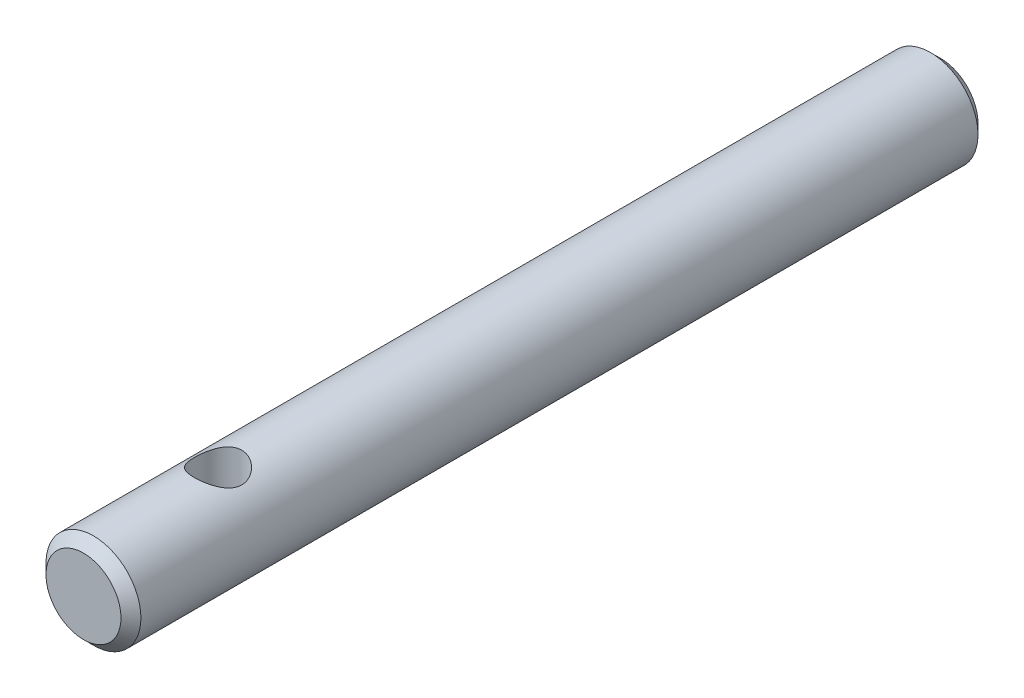
ISO-10303-21;
HEADER;
FILE_DESCRIPTION(('STEP AP214'),'2;1');
FILE_NAME('part.step','',(''),(''),'','','');
FILE_SCHEMA(('AUTOMOTIVE_DESIGN { 1 0 10303 214 1 1 1 1 }'));
ENDSEC;
DATA;
#1=APPLICATION_CONTEXT('core data for automotive mechanical design processes');
#2=APPLICATION_PROTOCOL_DEFINITION('international standard','automotive_design',2000,#1);
#3=PRODUCT_CONTEXT('',#1,'mechanical');
#4=PRODUCT('Part','Part','',(#3));
#5=PRODUCT_RELATED_PRODUCT_CATEGORY('part','',(#4));
#6=PRODUCT_DEFINITION_FORMATION('','',#4);
#7=PRODUCT_DEFINITION_CONTEXT('part definition',#1,'design');
#8=PRODUCT_DEFINITION('design','',#6,#7);
#9=PRODUCT_DEFINITION_SHAPE('','',#8);
#10=(LENGTH_UNIT() NAMED_UNIT(*) SI_UNIT(.MILLI.,.METRE.));
#11=(NAMED_UNIT(*) PLANE_ANGLE_UNIT() SI_UNIT($,.RADIAN.));
#12=(NAMED_UNIT(*) SI_UNIT($,.STERADIAN.) SOLID_ANGLE_UNIT());
#13=UNCERTAINTY_MEASURE_WITH_UNIT(LENGTH_MEASURE(1.E-05),#10,'distance_accuracy_value','');
#14=(GEOMETRIC_REPRESENTATION_CONTEXT(3) GLOBAL_UNCERTAINTY_ASSIGNED_CONTEXT((#13)) GLOBAL_UNIT_ASSIGNED_CONTEXT((#10,
#11,#12)) REPRESENTATION_CONTEXT('',''));
#15=CARTESIAN_POINT('',(0.,0.,0.));
#16=DIRECTION('',(0.,0.,1.));
#17=DIRECTION('',(1.,0.,0.));
#18=AXIS2_PLACEMENT_3D('',#15,#16,#17);
#19=CARTESIAN_POINT('',(0.,0.,-43.));
#20=DIRECTION('',(0.,0.,1.));
#21=DIRECTION('',(1.,0.,0.));
#22=AXIS2_PLACEMENT_3D('',#19,#20,#21);
#23=CYLINDRICAL_SURFACE('',#22,2.38125);
#24=CARTESIAN_POINT('',(0.,0.,-42.5));
#25=DIRECTION('',(0.,0.,1.));
#26=DIRECTION('',(1.,0.,0.));
#27=AXIS2_PLACEMENT_3D('',#24,#25,#26);
#28=CIRCLE('',#27,2.38125);
#29=CARTESIAN_POINT('',(2.38125,0.,-42.5));
#30=VERTEX_POINT('',#29);
#31=EDGE_CURVE('E42',#30,#30,#28,.T.);
#32=ORIENTED_EDGE('',*,*,#31,.T.);
#33=EDGE_LOOP('',(#32));
#34=FACE_BOUND('',#33,.T.);
#35=CARTESIAN_POINT('',(0.,0.,-0.499999999999994));
#36=DIRECTION('',(0.,0.,1.));
#37=DIRECTION('',(1.,0.,0.));
#38=AXIS2_PLACEMENT_3D('',#35,#36,#37);
#39=CIRCLE('',#38,2.38125);
#40=CARTESIAN_POINT('',(2.38125,0.,-0.499999999999994));
#41=VERTEX_POINT('',#40);
#42=EDGE_CURVE('E46',#41,#41,#39,.F.);
#43=ORIENTED_EDGE('',*,*,#42,.T.);
#44=EDGE_LOOP('',(#43));
#45=FACE_BOUND('',#44,.T.);
#46=CARTESIAN_POINT('',(0.,-2.38125,-5.559375));
#47=CARTESIAN_POINT('',(-0.0625934933908995,-2.38124658771817,-5.55937893182416));
#48=CARTESIAN_POINT('',(-0.12526160776547,-2.37875553370113,-5.56433999331049));
#49=CARTESIAN_POINT('',(-0.248745655116468,-2.36903604532025,-5.58396483565591));
#50=CARTESIAN_POINT('',(-0.309557840743265,-2.36179861446384,-5.59864704291283));
#51=CARTESIAN_POINT('',(-0.427355251873434,-2.34334382664568,-5.63699637838437));
#52=CARTESIAN_POINT('',(-0.484354349749461,-2.33214194770735,-5.66062858874529));
#53=CARTESIAN_POINT('',(-0.593493959385316,-2.30678565164099,-5.71602627106263));
#54=CARTESIAN_POINT('',(-0.645634853781903,-2.29263146732422,-5.74779110174629));
#55=CARTESIAN_POINT('',(-0.747126495522785,-2.26166669988499,-5.82073772516843));
#56=CARTESIAN_POINT('',(-0.796117610742265,-2.24474721461222,-5.8623729643447));
#57=CARTESIAN_POINT('',(-0.886753026544745,-2.2105140207503,-5.9529021362285));
#58=CARTESIAN_POINT('',(-0.928391728636494,-2.19320002298882,-6.00180154851656));
#59=CARTESIAN_POINT('',(-1.00637816303611,-2.15859063769341,-6.11001923802628));
#60=CARTESIAN_POINT('',(-1.04206516514117,-2.14140081986313,-6.1698514170931));
#61=CARTESIAN_POINT('',(-1.10271904514173,-2.11081118475794,-6.29561860940859));
#62=CARTESIAN_POINT('',(-1.12769358094429,-2.09740866244572,-6.36154922201052));
#63=CARTESIAN_POINT('',(-1.16458893898079,-2.07713897941891,-6.49361689114297));
#64=CARTESIAN_POINT('',(-1.1772017235864,-2.06992860854359,-6.55950530074274));
#65=CARTESIAN_POINT('',(-1.19113338890834,-2.06194687719966,-6.69282480373119));
#66=CARTESIAN_POINT('',(-1.19246343021919,-2.06116915374352,-6.76025430647472));
#67=CARTESIAN_POINT('',(-1.18429955128951,-2.06586451337536,-6.88607179770048));
#68=CARTESIAN_POINT('',(-1.17608099119853,-2.07060121735085,-6.94457673717494));
#69=CARTESIAN_POINT('',(-1.15126275778341,-2.0845013483624,-7.05923139834728));
#70=CARTESIAN_POINT('',(-1.13466041470314,-2.09366618546584,-7.11538036362914));
#71=CARTESIAN_POINT('',(-1.09324351977209,-2.1155915160392,-7.22533218596099));
#72=CARTESIAN_POINT('',(-1.06824668928498,-2.12843079040573,-7.27904993105433));
#73=CARTESIAN_POINT('',(-1.01089025937972,-2.15626240722546,-7.38178645461498));
#74=CARTESIAN_POINT('',(-0.978527352789219,-2.17125571566414,-7.43080310832385));
#75=CARTESIAN_POINT('',(-0.902572396630539,-2.204003536286,-7.5292893665474));
#76=CARTESIAN_POINT('',(-0.858076839495926,-2.22186710625626,-7.57802834010161));
#77=CARTESIAN_POINT('',(-0.761470860938948,-2.25680138992047,-7.66765685775979));
#78=CARTESIAN_POINT('',(-0.709356821108759,-2.27387172175947,-7.70854265051534));
#79=CARTESIAN_POINT('',(-0.595927464756045,-2.30626428608779,-7.78308824016352));
#80=CARTESIAN_POINT('',(-0.534297244998047,-2.3214685301789,-7.81632431250571));
#81=CARTESIAN_POINT('',(-0.40536758781635,-2.34741102209979,-7.87168427520433));
#82=CARTESIAN_POINT('',(-0.338072701740846,-2.35815281492167,-7.89381698903368));
#83=CARTESIAN_POINT('',(-0.205700104133524,-2.37320534860897,-7.92452227755017));
#84=CARTESIAN_POINT('',(-0.140900384809099,-2.37797504664999,-7.93406612756101));
#85=CARTESIAN_POINT('',(-0.0104532111896999,-2.38211931649743,-7.942368945507));
#86=CARTESIAN_POINT('',(0.0551938267826007,-2.38149644415062,-7.9411330225895));
#87=CARTESIAN_POINT('',(0.180061757270823,-2.37519200776753,-7.92847266160142));
#88=CARTESIAN_POINT('',(0.239386357709476,-2.36990626897501,-7.91784532821831));
#89=CARTESIAN_POINT('',(0.355290706146969,-2.35532022721706,-7.88795404564991));
#90=CARTESIAN_POINT('',(0.411870150775842,-2.34601948166815,-7.86868914431647));
#91=CARTESIAN_POINT('',(0.522551749435382,-2.323912493394,-7.82156432590301));
#92=CARTESIAN_POINT('',(0.576536816435451,-2.31101362357334,-7.79347440595467));
#93=CARTESIAN_POINT('',(0.679205558772777,-2.28295169421308,-7.72975634037143));
#94=CARTESIAN_POINT('',(0.727886962326195,-2.26778767095513,-7.6941249834997));
#95=CARTESIAN_POINT('',(0.823635905061683,-2.23490101029919,-7.61229774358805));
#96=CARTESIAN_POINT('',(0.87007550515996,-2.21707334772676,-7.56540802224747));
#97=CARTESIAN_POINT('',(0.95471018232545,-2.18196785003363,-7.46446411676999));
#98=CARTESIAN_POINT('',(0.992899556088157,-2.1646904022613,-7.41040501790926));
#99=CARTESIAN_POINT('',(1.06168973569882,-2.13182825744162,-7.29334927421775));
#100=CARTESIAN_POINT('',(1.0918334810305,-2.11636605630571,-7.23004658617039));
#101=CARTESIAN_POINT('',(1.14071736472268,-2.090428799133,-7.09824582565359));
#102=CARTESIAN_POINT('',(1.15947219672864,-2.07994732092736,-7.02975457625952));
#103=CARTESIAN_POINT('',(1.18331657161977,-2.06646662138444,-6.89655376590559));
#104=CARTESIAN_POINT('',(1.18954509883978,-2.06284572182647,-6.83211234201105));
#105=CARTESIAN_POINT('',(1.19144552443462,-2.06175000375602,-6.70303333564985));
#106=CARTESIAN_POINT('',(1.18712199863717,-2.06427252119055,-6.63839585034461));
#107=CARTESIAN_POINT('',(1.16910579328329,-2.07451954503311,-6.51725245598844));
#108=CARTESIAN_POINT('',(1.1563448992644,-2.081725593681,-6.46055850273432));
#109=CARTESIAN_POINT('',(1.12296816088622,-2.09991741148739,-6.35017845780996));
#110=CARTESIAN_POINT('',(1.10234978978715,-2.11090439637645,-6.29649334007175));
#111=CARTESIAN_POINT('',(1.05229312174863,-2.13632093965266,-6.18966228679407));
#112=CARTESIAN_POINT('',(1.02235532346272,-2.15093219477964,-6.13679490438401));
#113=CARTESIAN_POINT('',(0.955061000604868,-2.18164566727434,-6.03648875535999));
#114=CARTESIAN_POINT('',(0.917700616381016,-2.19774865799103,-5.98905283335142));
#115=CARTESIAN_POINT('',(0.831298335810089,-2.23197328511557,-5.89496220225546));
#116=CARTESIAN_POINT('',(0.781388641146486,-2.25010245755217,-5.84910275625034));
#117=CARTESIAN_POINT('',(0.674078066156022,-2.28454448778714,-5.76623063536124));
#118=CARTESIAN_POINT('',(0.616673173627611,-2.30085636405197,-5.72922272899558));
#119=CARTESIAN_POINT('',(0.495218557463749,-2.33002942662263,-5.66505920558625));
#120=CARTESIAN_POINT('',(0.43112472187215,-2.34286539970213,-5.63797509829451));
#121=CARTESIAN_POINT('',(0.298539814353396,-2.36340659560876,-5.5953221500715));
#122=CARTESIAN_POINT('',(0.230061848926332,-2.37112639390897,-5.57972058236853));
#123=CARTESIAN_POINT('',(0.134066692531779,-2.37762409336193,-5.56664089493782));
#124=CARTESIAN_POINT('',(0.107348987707653,-2.37898025606987,-5.56392004322175));
#125=CARTESIAN_POINT('',(0.0537587806828968,-2.3807939546427,-5.56028622636905));
#126=CARTESIAN_POINT('',(0.0268862742301633,-2.38125146570418,-5.55937331113273));
#127=CARTESIAN_POINT('',(0.,-2.38125,-5.559375));
#128=B_SPLINE_CURVE_WITH_KNOTS('',3,(#46,#47,#48,#49,#50,#51,#52,#53,#54,#55,#56,#57,#58,#59,
#60,#61,#62,#63,#64,#65,#66,#67,#68,#69,#70,#71,#72,#73,#74,#75,#76,#77,#78,#79,#80,#81,#82,#83,
#84,#85,#86,#87,#88,#89,#90,#91,#92,#93,#94,#95,#96,#97,#98,#99,#100,#101,#102,#103,#104,#105,
#106,#107,#108,#109,#110,#111,#112,#113,#114,#115,#116,#117,#118,#119,#120,#121,#122,#123,#124,
#125,#126,#127),.UNSPECIFIED.,.T.,.F.,(4,2,2,2,2,2,2,2,2,2,2,2,2,2,2,2,2,2,2,2,2,2,2,2,2,2,2,2,
2,2,2,2,2,2,2,2,2,2,2,2,4),(0.,0.187671381491036,0.375699515747513,0.563001503883017,
0.750288727442429,0.948906406473724,1.14767467670684,1.36185743031615,1.57588681716391,
1.7771032070446,1.97812053569865,2.15509926337347,2.33213438424011,2.51329317200605,
2.69453345625451,2.89875445775649,3.10307277131561,3.31687910824068,3.53051527011183,
3.72645730217446,3.92230647121476,4.10297598058851,4.28366541066828,4.46952119208217,
4.65545627297241,4.85965036423511,5.06398516445248,5.27821543446362,5.49216872029488,
5.68558331740251,5.87891405645819,6.0538272319698,6.22879670208066,6.41552156348465,
6.60234377481071,6.81186617152193,7.02150118957732,7.2326184126742,7.44313156831557,
7.52374130413946,7.60435326481739),.UNSPECIFIED.);
#129=CARTESIAN_POINT('',(0.,-2.38125,-5.559375));
#130=VERTEX_POINT('',#129);
#131=EDGE_CURVE('E51',#130,#130,#128,.T.);
#132=ORIENTED_EDGE('',*,*,#131,.F.);
#133=EDGE_LOOP('',(#132));
#134=FACE_BOUND('',#133,.T.);
#135=CARTESIAN_POINT('',(0.,2.38125,-5.559375));
#136=CARTESIAN_POINT('',(0.0625934933908996,2.38124658771817,-5.55937893182416));
#137=CARTESIAN_POINT('',(0.12526160776547,2.37875553370113,-5.56433999331049));
#138=CARTESIAN_POINT('',(0.248745655116469,2.36903604532025,-5.58396483565591));
#139=CARTESIAN_POINT('',(0.309557840743265,2.36179861446384,-5.59864704291283));
#140=CARTESIAN_POINT('',(0.427355251873434,2.34334382664568,-5.63699637838437));
#141=CARTESIAN_POINT('',(0.484354349749461,2.33214194770735,-5.66062858874529));
#142=CARTESIAN_POINT('',(0.593493959385317,2.30678565164099,-5.71602627106263));
#143=CARTESIAN_POINT('',(0.645634853781903,2.29263146732422,-5.74779110174629));
#144=CARTESIAN_POINT('',(0.747126495522785,2.26166669988499,-5.82073772516843));
#145=CARTESIAN_POINT('',(0.796117610742264,2.24474721461222,-5.8623729643447));
#146=CARTESIAN_POINT('',(0.886753026544745,2.2105140207503,-5.9529021362285));
#147=CARTESIAN_POINT('',(0.928391728636494,2.19320002298882,-6.00180154851656));
#148=CARTESIAN_POINT('',(1.00637816303611,2.15859063769341,-6.11001923802628));
#149=CARTESIAN_POINT('',(1.04206516514117,2.14140081986313,-6.1698514170931));
#150=CARTESIAN_POINT('',(1.10271904514173,2.11081118475794,-6.29561860940859));
#151=CARTESIAN_POINT('',(1.12769358094429,2.09740866244572,-6.36154922201052));
#152=CARTESIAN_POINT('',(1.16458893898079,2.07713897941891,-6.49361689114297));
#153=CARTESIAN_POINT('',(1.1772017235864,2.06992860854359,-6.55950530074274));
#154=CARTESIAN_POINT('',(1.19113338890834,2.06194687719966,-6.69282480373119));
#155=CARTESIAN_POINT('',(1.19246343021919,2.06116915374352,-6.76025430647472));
#156=CARTESIAN_POINT('',(1.18429955128951,2.06586451337536,-6.88607179770049));
#157=CARTESIAN_POINT('',(1.17608099119853,2.07060121735085,-6.94457673717494));
#158=CARTESIAN_POINT('',(1.15126275778341,2.0845013483624,-7.05923139834728));
#159=CARTESIAN_POINT('',(1.13466041470314,2.09366618546584,-7.11538036362914));
#160=CARTESIAN_POINT('',(1.09324351977209,2.1155915160392,-7.22533218596099));
#161=CARTESIAN_POINT('',(1.06824668928498,2.12843079040573,-7.27904993105433));
#162=CARTESIAN_POINT('',(1.01089025937972,2.15626240722546,-7.38178645461498));
#163=CARTESIAN_POINT('',(0.978527352789219,2.17125571566414,-7.43080310832385));
#164=CARTESIAN_POINT('',(0.902572396630539,2.204003536286,-7.5292893665474));
#165=CARTESIAN_POINT('',(0.858076839495927,2.22186710625626,-7.57802834010161));
#166=CARTESIAN_POINT('',(0.761470860938949,2.25680138992047,-7.66765685775979));
#167=CARTESIAN_POINT('',(0.709356821108759,2.27387172175947,-7.70854265051534));
#168=CARTESIAN_POINT('',(0.595927464756046,2.30626428608779,-7.78308824016352));
#169=CARTESIAN_POINT('',(0.534297244998048,2.3214685301789,-7.81632431250571));
#170=CARTESIAN_POINT('',(0.405367587816352,2.34741102209979,-7.87168427520433));
#171=CARTESIAN_POINT('',(0.338072701740848,2.35815281492167,-7.89381698903368));
#172=CARTESIAN_POINT('',(0.205700104133525,2.37320534860897,-7.92452227755016));
#173=CARTESIAN_POINT('',(0.140900384809101,2.37797504664999,-7.93406612756101));
#174=CARTESIAN_POINT('',(0.0104532111897008,2.38211931649743,-7.942368945507));
#175=CARTESIAN_POINT('',(-0.0551938267826001,2.38149644415062,-7.9411330225895));
#176=CARTESIAN_POINT('',(-0.180061757270823,2.37519200776753,-7.92847266160142));
#177=CARTESIAN_POINT('',(-0.239386357709476,2.36990626897501,-7.91784532821831));
#178=CARTESIAN_POINT('',(-0.355290706146969,2.35532022721706,-7.88795404564991));
#179=CARTESIAN_POINT('',(-0.411870150775842,2.34601948166815,-7.86868914431647));
#180=CARTESIAN_POINT('',(-0.522551749435382,2.323912493394,-7.82156432590301));
#181=CARTESIAN_POINT('',(-0.576536816435451,2.31101362357334,-7.79347440595467));
#182=CARTESIAN_POINT('',(-0.679205558772777,2.28295169421308,-7.72975634037143));
#183=CARTESIAN_POINT('',(-0.727886962326195,2.26778767095513,-7.6941249834997));
#184=CARTESIAN_POINT('',(-0.823635905061684,2.23490101029919,-7.61229774358805));
#185=CARTESIAN_POINT('',(-0.870075505159961,2.21707334772675,-7.56540802224747));
#186=CARTESIAN_POINT('',(-0.954710182325451,2.18196785003363,-7.46446411676999));
#187=CARTESIAN_POINT('',(-0.992899556088158,2.1646904022613,-7.41040501790926));
#188=CARTESIAN_POINT('',(-1.06168973569882,2.13182825744162,-7.29334927421775));
#189=CARTESIAN_POINT('',(-1.0918334810305,2.11636605630571,-7.23004658617039));
#190=CARTESIAN_POINT('',(-1.14071736472268,2.090428799133,-7.09824582565359));
#191=CARTESIAN_POINT('',(-1.15947219672864,2.07994732092736,-7.02975457625952));
#192=CARTESIAN_POINT('',(-1.18331657161977,2.06646662138444,-6.89655376590559));
#193=CARTESIAN_POINT('',(-1.18954509883978,2.06284572182647,-6.83211234201105));
#194=CARTESIAN_POINT('',(-1.19144552443462,2.06175000375602,-6.70303333564985));
#195=CARTESIAN_POINT('',(-1.18712199863717,2.06427252119055,-6.63839585034461));
#196=CARTESIAN_POINT('',(-1.16910579328329,2.07451954503311,-6.51725245598844));
#197=CARTESIAN_POINT('',(-1.1563448992644,2.081725593681,-6.46055850273432));
#198=CARTESIAN_POINT('',(-1.12296816088622,2.09991741148739,-6.35017845780996));
#199=CARTESIAN_POINT('',(-1.10234978978715,2.11090439637645,-6.29649334007175));
#200=CARTESIAN_POINT('',(-1.05229312174863,2.13632093965266,-6.18966228679407));
#201=CARTESIAN_POINT('',(-1.02235532346272,2.15093219477964,-6.13679490438401));
#202=CARTESIAN_POINT('',(-0.955061000604868,2.18164566727434,-6.03648875535999));
#203=CARTESIAN_POINT('',(-0.917700616381016,2.19774865799103,-5.98905283335142));
#204=CARTESIAN_POINT('',(-0.831298335810089,2.23197328511557,-5.89496220225546));
#205=CARTESIAN_POINT('',(-0.781388641146486,2.25010245755217,-5.84910275625034));
#206=CARTESIAN_POINT('',(-0.674078066156021,2.28454448778714,-5.76623063536124));
#207=CARTESIAN_POINT('',(-0.61667317362761,2.30085636405197,-5.72922272899558));
#208=CARTESIAN_POINT('',(-0.49521855746375,2.33002942662263,-5.66505920558625));
#209=CARTESIAN_POINT('',(-0.431124721872151,2.34286539970213,-5.63797509829451));
#210=CARTESIAN_POINT('',(-0.298539814353397,2.36340659560876,-5.5953221500715));
#211=CARTESIAN_POINT('',(-0.230061848926333,2.37112639390897,-5.57972058236853));
#212=CARTESIAN_POINT('',(-0.134066692531779,2.37762409336193,-5.56664089493782));
#213=CARTESIAN_POINT('',(-0.107348987707653,2.37898025606987,-5.56392004322175));
#214=CARTESIAN_POINT('',(-0.0537587806828973,2.3807939546427,-5.56028622636905));
#215=CARTESIAN_POINT('',(-0.0268862742301636,2.38125146570418,-5.55937331113273));
#216=CARTESIAN_POINT('',(0.,2.38125,-5.559375));
#217=B_SPLINE_CURVE_WITH_KNOTS('',3,(#135,#136,#137,#138,#139,#140,#141,#142,#143,#144,#145,
#146,#147,#148,#149,#150,#151,#152,#153,#154,#155,#156,#157,#158,#159,#160,#161,#162,#163,#164,
#165,#166,#167,#168,#169,#170,#171,#172,#173,#174,#175,#176,#177,#178,#179,#180,#181,#182,#183,
#184,#185,#186,#187,#188,#189,#190,#191,#192,#193,#194,#195,#196,#197,#198,#199,#200,#201,#202,
#203,#204,#205,#206,#207,#208,#209,#210,#211,#212,#213,#214,#215,#216),.UNSPECIFIED.,.T.,.F.,(4,
2,2,2,2,2,2,2,2,2,2,2,2,2,2,2,2,2,2,2,2,2,2,2,2,2,2,2,2,2,2,2,2,2,2,2,2,2,2,2,4),(0.,
0.187671381491036,0.375699515747513,0.563001503883018,0.750288727442429,0.948906406473725,
1.14767467670684,1.36185743031615,1.57588681716391,1.7771032070446,1.97812053569865,
2.15509926337347,2.33213438424011,2.51329317200605,2.69453345625451,2.89875445775649,
3.10307277131561,3.31687910824068,3.53051527011182,3.72645730217446,3.92230647121476,
4.10297598058851,4.28366541066828,4.46952119208217,4.65545627297241,4.85965036423511,
5.06398516445248,5.27821543446362,5.49216872029488,5.68558331740251,5.87891405645819,
6.0538272319698,6.22879670208066,6.41552156348465,6.60234377481071,6.81186617152193,
7.02150118957731,7.2326184126742,7.44313156831557,7.52374130413946,7.60435326481739),.UNSPECIFIED.);
#218=CARTESIAN_POINT('',(0.,2.38125,-5.559375));
#219=VERTEX_POINT('',#218);
#220=EDGE_CURVE('E59',#219,#219,#217,.T.);
#221=ORIENTED_EDGE('',*,*,#220,.F.);
#222=EDGE_LOOP('',(#221));
#223=FACE_BOUND('',#222,.T.);
#224=ADVANCED_FACE('F31',(#34,#45,#134,#223),#23,.T.);
#225=CARTESIAN_POINT('',(0.,0.,-43.));
#226=DIRECTION('',(0.,0.,1.));
#227=DIRECTION('',(1.,0.,0.));
#228=AXIS2_PLACEMENT_3D('',#225,#226,#227);
#229=PLANE('',#228);
#230=CARTESIAN_POINT('',(0.,0.,-43.));
#231=DIRECTION('',(0.,0.,1.));
#232=DIRECTION('',(1.,0.,0.));
#233=AXIS2_PLACEMENT_3D('',#230,#231,#232);
#234=CIRCLE('',#233,1.88124999999999);
#235=CARTESIAN_POINT('',(1.88124999999999,0.,-43.));
#236=VERTEX_POINT('',#235);
#237=EDGE_CURVE('E38',#236,#236,#234,.F.);
#238=ORIENTED_EDGE('',*,*,#237,.T.);
#239=EDGE_LOOP('',(#238));
#240=FACE_BOUND('',#239,.T.);
#241=ADVANCED_FACE('F72',(#240),#229,.F.);
#242=CARTESIAN_POINT('',(0.,0.,0.));
#243=DIRECTION('',(0.,0.,1.));
#244=DIRECTION('',(1.,0.,0.));
#245=AXIS2_PLACEMENT_3D('',#242,#243,#244);
#246=PLANE('',#245);
#247=CARTESIAN_POINT('',(0.,0.,0.));
#248=DIRECTION('',(0.,0.,1.));
#249=DIRECTION('',(1.,0.,0.));
#250=AXIS2_PLACEMENT_3D('',#247,#248,#249);
#251=CIRCLE('',#250,1.88125000000001);
#252=CARTESIAN_POINT('',(1.88125000000001,0.,0.));
#253=VERTEX_POINT('',#252);
#254=EDGE_CURVE('E10',#253,#253,#251,.T.);
#255=ORIENTED_EDGE('',*,*,#254,.T.);
#256=EDGE_LOOP('',(#255));
#257=FACE_BOUND('',#256,.T.);
#258=ADVANCED_FACE('F70',(#257),#246,.T.);
#259=CARTESIAN_POINT('',(0.,-2.38125,-6.75));
#260=DIRECTION('',(0.,1.,0.));
#261=DIRECTION('',(0.,0.,1.));
#262=AXIS2_PLACEMENT_3D('',#259,#260,#261);
#263=CYLINDRICAL_SURFACE('',#262,1.190625);
#264=ORIENTED_EDGE('',*,*,#131,.T.);
#265=EDGE_LOOP('',(#264));
#266=FACE_BOUND('',#265,.T.);
#267=ORIENTED_EDGE('',*,*,#220,.T.);
#268=EDGE_LOOP('',(#267));
#269=FACE_BOUND('',#268,.T.);
#270=ADVANCED_FACE('F65',(#266,#269),#263,.F.);
#271=CARTESIAN_POINT('',(0.,0.,-42.5));
#272=DIRECTION('',(0.,0.,1.));
#273=DIRECTION('',(1.,0.,0.));
#274=AXIS2_PLACEMENT_3D('',#271,#272,#273);
#275=CONICAL_SURFACE('',#274,2.38125,0.785398163397447);
#276=ORIENTED_EDGE('',*,*,#237,.F.);
#277=EDGE_LOOP('',(#276));
#278=FACE_BOUND('',#277,.T.);
#279=ORIENTED_EDGE('',*,*,#31,.F.);
#280=EDGE_LOOP('',(#279));
#281=FACE_BOUND('',#280,.T.);
#282=ADVANCED_FACE('F69',(#278,#281),#275,.T.);
#283=CARTESIAN_POINT('',(0.,0.,0.));
#284=DIRECTION('',(0.,0.,-1.));
#285=DIRECTION('',(-1.,0.,0.));
#286=AXIS2_PLACEMENT_3D('',#283,#284,#285);
#287=CONICAL_SURFACE('',#286,1.88125000000001,0.78539816339744);
#288=ORIENTED_EDGE('',*,*,#42,.F.);
#289=EDGE_LOOP('',(#288));
#290=FACE_BOUND('',#289,.T.);
#291=ORIENTED_EDGE('',*,*,#254,.F.);
#292=EDGE_LOOP('',(#291));
#293=FACE_BOUND('',#292,.T.);
#294=ADVANCED_FACE('F33',(#290,#293),#287,.T.);
#295=CLOSED_SHELL('',(#224,#241,#258,#270,#282,#294));
#296=MANIFOLD_SOLID_BREP('B2',#295);
#297=ADVANCED_BREP_SHAPE_REPRESENTATION('',(#18,#296),#14);
#298=SHAPE_DEFINITION_REPRESENTATION(#9,#297);
ENDSEC;
END-ISO-10303-21;
